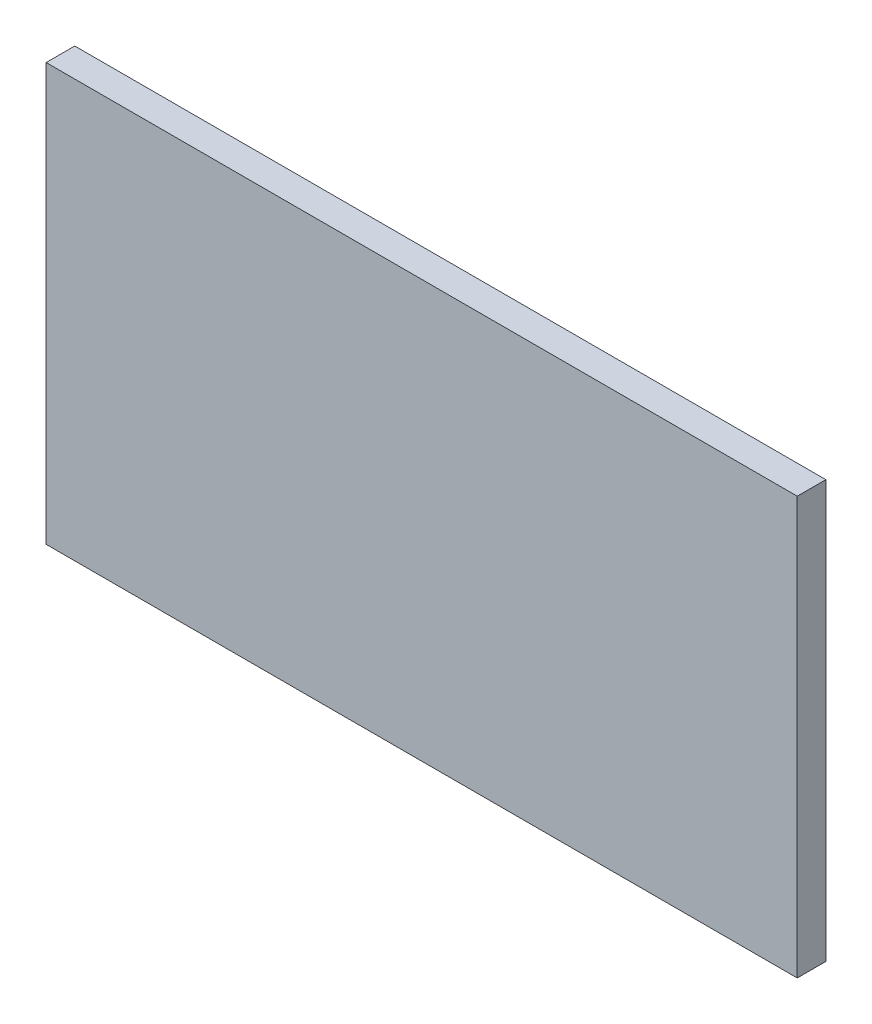
ISO-10303-21;
HEADER;
FILE_DESCRIPTION(('STEP AP214'),'2;1');
FILE_NAME('part.step','',(''),(''),'','','');
FILE_SCHEMA(('AUTOMOTIVE_DESIGN { 1 0 10303 214 1 1 1 1 }'));
ENDSEC;
DATA;
#1=APPLICATION_CONTEXT('core data for automotive mechanical design processes');
#2=APPLICATION_PROTOCOL_DEFINITION('international standard','automotive_design',2000,#1);
#3=PRODUCT_CONTEXT('',#1,'mechanical');
#4=PRODUCT('Part','Part','',(#3));
#5=PRODUCT_RELATED_PRODUCT_CATEGORY('part','',(#4));
#6=PRODUCT_DEFINITION_FORMATION('','',#4);
#7=PRODUCT_DEFINITION_CONTEXT('part definition',#1,'design');
#8=PRODUCT_DEFINITION('design','',#6,#7);
#9=PRODUCT_DEFINITION_SHAPE('','',#8);
#10=(LENGTH_UNIT() NAMED_UNIT(*) SI_UNIT(.MILLI.,.METRE.));
#11=(NAMED_UNIT(*) PLANE_ANGLE_UNIT() SI_UNIT($,.RADIAN.));
#12=(NAMED_UNIT(*) SI_UNIT($,.STERADIAN.) SOLID_ANGLE_UNIT());
#13=UNCERTAINTY_MEASURE_WITH_UNIT(LENGTH_MEASURE(1.E-05),#10,'distance_accuracy_value','');
#14=(GEOMETRIC_REPRESENTATION_CONTEXT(3) GLOBAL_UNCERTAINTY_ASSIGNED_CONTEXT((#13)) GLOBAL_UNIT_ASSIGNED_CONTEXT((#10,
#11,#12)) REPRESENTATION_CONTEXT('',''));
#15=CARTESIAN_POINT('',(0.,0.,0.));
#16=DIRECTION('',(0.,0.,1.));
#17=DIRECTION('',(1.,0.,0.));
#18=AXIS2_PLACEMENT_3D('',#15,#16,#17);
#19=CARTESIAN_POINT('',(0.70008,8.,0.));
#20=DIRECTION('',(0.,0.,-1.));
#21=DIRECTION('',(-1.,0.,0.));
#22=AXIS2_PLACEMENT_3D('',#19,#20,#21);
#23=PLANE('',#22);
#24=DIRECTION('',(1.,0.,0.));
#25=VECTOR('',#24,1.);
#26=CARTESIAN_POINT('',(0.25008,8.25,0.));
#27=LINE('',#26,#25);
#28=CARTESIAN_POINT('',(0.25008,8.25,0.));
#29=VERTEX_POINT('',#28);
#30=CARTESIAN_POINT('',(1.15008,8.25,0.));
#31=VERTEX_POINT('',#30);
#32=EDGE_CURVE('E55',#29,#31,#27,.T.);
#33=ORIENTED_EDGE('',*,*,#32,.T.);
#34=DIRECTION('',(0.,1.,0.));
#35=VECTOR('',#34,1.);
#36=CARTESIAN_POINT('',(1.15008,8.25,0.));
#37=LINE('',#36,#35);
#38=CARTESIAN_POINT('',(1.15008,7.75,0.));
#39=VERTEX_POINT('',#38);
#40=EDGE_CURVE('E57',#31,#39,#37,.F.);
#41=ORIENTED_EDGE('',*,*,#40,.T.);
#42=DIRECTION('',(1.,0.,0.));
#43=VECTOR('',#42,1.);
#44=CARTESIAN_POINT('',(1.15008,7.75,0.));
#45=LINE('',#44,#43);
#46=CARTESIAN_POINT('',(0.25008,7.75,0.));
#47=VERTEX_POINT('',#46);
#48=EDGE_CURVE('E20',#39,#47,#45,.F.);
#49=ORIENTED_EDGE('',*,*,#48,.T.);
#50=DIRECTION('',(0.,1.,0.));
#51=VECTOR('',#50,1.);
#52=CARTESIAN_POINT('',(0.25008,7.75,0.));
#53=LINE('',#52,#51);
#54=EDGE_CURVE('E80',#47,#29,#53,.T.);
#55=ORIENTED_EDGE('',*,*,#54,.T.);
#56=EDGE_LOOP('',(#33,#41,#49,#55));
#57=FACE_BOUND('',#56,.T.);
#58=ADVANCED_FACE('F17',(#57),#23,.T.);
#59=CARTESIAN_POINT('',(1.15008,7.75,0.));
#60=DIRECTION('',(0.,1.,0.));
#61=DIRECTION('',(0.,0.,1.));
#62=AXIS2_PLACEMENT_3D('',#59,#60,#61);
#63=PLANE('',#62);
#64=DIRECTION('',(0.,0.,-1.));
#65=VECTOR('',#64,1.);
#66=CARTESIAN_POINT('',(0.25008,7.75,0.));
#67=LINE('',#66,#65);
#68=CARTESIAN_POINT('',(0.25008,7.75,0.03429));
#69=VERTEX_POINT('',#68);
#70=EDGE_CURVE('E68',#69,#47,#67,.T.);
#71=ORIENTED_EDGE('',*,*,#70,.T.);
#72=ORIENTED_EDGE('',*,*,#48,.F.);
#73=DIRECTION('',(0.,0.,1.));
#74=VECTOR('',#73,1.);
#75=CARTESIAN_POINT('',(1.15008,7.75,0.));
#76=LINE('',#75,#74);
#77=CARTESIAN_POINT('',(1.15008,7.75,0.03429));
#78=VERTEX_POINT('',#77);
#79=EDGE_CURVE('E63',#39,#78,#76,.T.);
#80=ORIENTED_EDGE('',*,*,#79,.T.);
#81=DIRECTION('',(1.,0.,0.));
#82=VECTOR('',#81,1.);
#83=CARTESIAN_POINT('',(0.70008,7.75,0.03429));
#84=LINE('',#83,#82);
#85=EDGE_CURVE('E83',#69,#78,#84,.T.);
#86=ORIENTED_EDGE('',*,*,#85,.F.);
#87=EDGE_LOOP('',(#71,#72,#80,#86));
#88=FACE_BOUND('',#87,.T.);
#89=ADVANCED_FACE('F65',(#88),#63,.F.);
#90=CARTESIAN_POINT('',(1.15008,8.25,0.));
#91=DIRECTION('',(-1.,0.,0.));
#92=DIRECTION('',(0.,0.,1.));
#93=AXIS2_PLACEMENT_3D('',#90,#91,#92);
#94=PLANE('',#93);
#95=ORIENTED_EDGE('',*,*,#79,.F.);
#96=ORIENTED_EDGE('',*,*,#40,.F.);
#97=DIRECTION('',(0.,0.,-1.));
#98=VECTOR('',#97,1.);
#99=CARTESIAN_POINT('',(1.15008,8.25,0.));
#100=LINE('',#99,#98);
#101=CARTESIAN_POINT('',(1.15008,8.25,0.03429));
#102=VERTEX_POINT('',#101);
#103=EDGE_CURVE('E75',#31,#102,#100,.F.);
#104=ORIENTED_EDGE('',*,*,#103,.T.);
#105=DIRECTION('',(0.,1.,0.));
#106=VECTOR('',#105,1.);
#107=CARTESIAN_POINT('',(1.15008,8.,0.03429));
#108=LINE('',#107,#106);
#109=EDGE_CURVE('E72',#78,#102,#108,.T.);
#110=ORIENTED_EDGE('',*,*,#109,.F.);
#111=EDGE_LOOP('',(#95,#96,#104,#110));
#112=FACE_BOUND('',#111,.T.);
#113=ADVANCED_FACE('F70',(#112),#94,.F.);
#114=CARTESIAN_POINT('',(0.25008,8.25,0.));
#115=DIRECTION('',(0.,-1.,0.));
#116=DIRECTION('',(0.,0.,-1.));
#117=AXIS2_PLACEMENT_3D('',#114,#115,#116);
#118=PLANE('',#117);
#119=ORIENTED_EDGE('',*,*,#103,.F.);
#120=ORIENTED_EDGE('',*,*,#32,.F.);
#121=DIRECTION('',(0.,0.,-1.));
#122=VECTOR('',#121,1.);
#123=CARTESIAN_POINT('',(0.25008,8.25,0.));
#124=LINE('',#123,#122);
#125=CARTESIAN_POINT('',(0.25008,8.25,0.03429));
#126=VERTEX_POINT('',#125);
#127=EDGE_CURVE('E35',#29,#126,#124,.F.);
#128=ORIENTED_EDGE('',*,*,#127,.T.);
#129=DIRECTION('',(1.,0.,0.));
#130=VECTOR('',#129,1.);
#131=CARTESIAN_POINT('',(0.70008,8.25,0.03429));
#132=LINE('',#131,#130);
#133=EDGE_CURVE('E26',#102,#126,#132,.F.);
#134=ORIENTED_EDGE('',*,*,#133,.F.);
#135=EDGE_LOOP('',(#119,#120,#128,#134));
#136=FACE_BOUND('',#135,.T.);
#137=ADVANCED_FACE('F89',(#136),#118,.F.);
#138=CARTESIAN_POINT('',(0.25008,7.75,0.));
#139=DIRECTION('',(1.,0.,0.));
#140=DIRECTION('',(0.,0.,-1.));
#141=AXIS2_PLACEMENT_3D('',#138,#139,#140);
#142=PLANE('',#141);
#143=ORIENTED_EDGE('',*,*,#127,.F.);
#144=ORIENTED_EDGE('',*,*,#54,.F.);
#145=ORIENTED_EDGE('',*,*,#70,.F.);
#146=DIRECTION('',(0.,1.,0.));
#147=VECTOR('',#146,1.);
#148=CARTESIAN_POINT('',(0.25008,8.,0.03429));
#149=LINE('',#148,#147);
#150=EDGE_CURVE('E11',#126,#69,#149,.F.);
#151=ORIENTED_EDGE('',*,*,#150,.F.);
#152=EDGE_LOOP('',(#143,#144,#145,#151));
#153=FACE_BOUND('',#152,.T.);
#154=ADVANCED_FACE('F91',(#153),#142,.F.);
#155=CARTESIAN_POINT('',(0.70008,8.,0.03429));
#156=DIRECTION('',(0.,0.,1.));
#157=DIRECTION('',(1.,0.,0.));
#158=AXIS2_PLACEMENT_3D('',#155,#156,#157);
#159=PLANE('',#158);
#160=ORIENTED_EDGE('',*,*,#133,.T.);
#161=ORIENTED_EDGE('',*,*,#150,.T.);
#162=ORIENTED_EDGE('',*,*,#85,.T.);
#163=ORIENTED_EDGE('',*,*,#109,.T.);
#164=EDGE_LOOP('',(#160,#161,#162,#163));
#165=FACE_BOUND('',#164,.T.);
#166=ADVANCED_FACE('F88',(#165),#159,.T.);
#167=CLOSED_SHELL('',(#58,#89,#113,#137,#154,#166));
#168=MANIFOLD_SOLID_BREP('B1',#167);
#169=ADVANCED_BREP_SHAPE_REPRESENTATION('',(#18,#168),#14);
#170=SHAPE_DEFINITION_REPRESENTATION(#9,#169);
ENDSEC;
END-ISO-10303-21;
